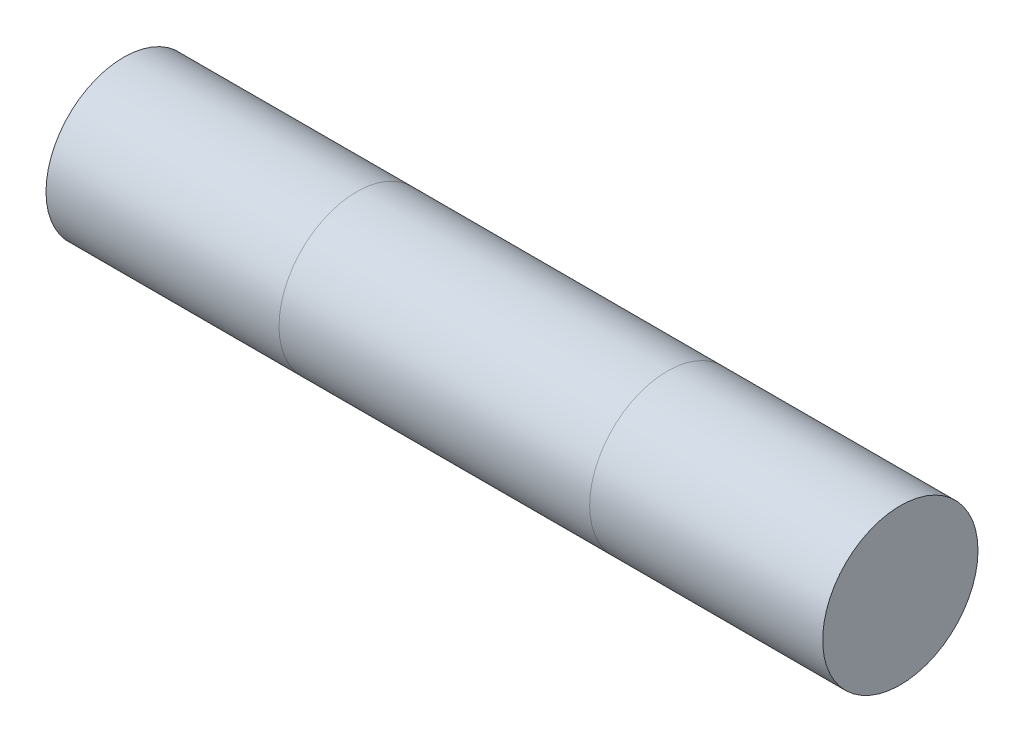
ISO-10303-21;
HEADER;
FILE_DESCRIPTION(('STEP AP214'),'2;1');
FILE_NAME('part.step','',(''),(''),'','','');
FILE_SCHEMA(('AUTOMOTIVE_DESIGN { 1 0 10303 214 1 1 1 1 }'));
ENDSEC;
DATA;
#1=APPLICATION_CONTEXT('core data for automotive mechanical design processes');
#2=APPLICATION_PROTOCOL_DEFINITION('international standard','automotive_design',2000,#1);
#3=PRODUCT_CONTEXT('',#1,'mechanical');
#4=PRODUCT('Part','Part','',(#3));
#5=PRODUCT_RELATED_PRODUCT_CATEGORY('part','',(#4));
#6=PRODUCT_DEFINITION_FORMATION('','',#4);
#7=PRODUCT_DEFINITION_CONTEXT('part definition',#1,'design');
#8=PRODUCT_DEFINITION('design','',#6,#7);
#9=PRODUCT_DEFINITION_SHAPE('','',#8);
#10=(LENGTH_UNIT() NAMED_UNIT(*) SI_UNIT(.MILLI.,.METRE.));
#11=(NAMED_UNIT(*) PLANE_ANGLE_UNIT() SI_UNIT($,.RADIAN.));
#12=(NAMED_UNIT(*) SI_UNIT($,.STERADIAN.) SOLID_ANGLE_UNIT());
#13=UNCERTAINTY_MEASURE_WITH_UNIT(LENGTH_MEASURE(1.E-05),#10,'distance_accuracy_value','');
#14=(GEOMETRIC_REPRESENTATION_CONTEXT(3) GLOBAL_UNCERTAINTY_ASSIGNED_CONTEXT((#13)) GLOBAL_UNIT_ASSIGNED_CONTEXT((#10,
#11,#12)) REPRESENTATION_CONTEXT('',''));
#15=CARTESIAN_POINT('',(0.,0.,0.));
#16=DIRECTION('',(0.,0.,1.));
#17=DIRECTION('',(1.,0.,0.));
#18=AXIS2_PLACEMENT_3D('',#15,#16,#17);
#19=CARTESIAN_POINT('',(25.,0.,0.));
#20=DIRECTION('',(-1.,0.,0.));
#21=DIRECTION('',(0.,0.,1.));
#22=AXIS2_PLACEMENT_3D('',#19,#20,#21);
#23=CYLINDRICAL_SURFACE('',#22,5.);
#24=CARTESIAN_POINT('',(-25.,0.,0.));
#25=DIRECTION('',(1.,0.,0.));
#26=DIRECTION('',(0.,0.,-1.));
#27=AXIS2_PLACEMENT_3D('',#24,#25,#26);
#28=CIRCLE('',#27,5.);
#29=CARTESIAN_POINT('',(-25.,0.,-5.));
#30=VERTEX_POINT('',#29);
#31=EDGE_CURVE('E54',#30,#30,#28,.T.);
#32=ORIENTED_EDGE('',*,*,#31,.T.);
#33=EDGE_LOOP('',(#32));
#34=FACE_BOUND('',#33,.T.);
#35=CARTESIAN_POINT('',(-10.,0.,0.));
#36=DIRECTION('',(-1.,0.,0.));
#37=DIRECTION('',(0.,0.,1.));
#38=AXIS2_PLACEMENT_3D('',#35,#36,#37);
#39=CIRCLE('',#38,5.);
#40=CARTESIAN_POINT('',(-10.,0.,5.));
#41=VERTEX_POINT('',#40);
#42=EDGE_CURVE('E11',#41,#41,#39,.T.);
#43=ORIENTED_EDGE('',*,*,#42,.T.);
#44=EDGE_LOOP('',(#43));
#45=FACE_BOUND('',#44,.T.);
#46=ADVANCED_FACE('F39',(#34,#45),#23,.T.);
#47=CARTESIAN_POINT('',(25.,0.,0.));
#48=DIRECTION('',(1.,0.,0.));
#49=DIRECTION('',(0.,0.,-1.));
#50=AXIS2_PLACEMENT_3D('',#47,#48,#49);
#51=CIRCLE('',#50,5.);
#52=CARTESIAN_POINT('',(25.,0.,-5.));
#53=VERTEX_POINT('',#52);
#54=EDGE_CURVE('E50',#53,#53,#51,.T.);
#55=ORIENTED_EDGE('',*,*,#54,.F.);
#56=EDGE_LOOP('',(#55));
#57=FACE_BOUND('',#56,.T.);
#58=CARTESIAN_POINT('',(10.,0.,0.));
#59=DIRECTION('',(1.,0.,0.));
#60=DIRECTION('',(0.,0.,-1.));
#61=AXIS2_PLACEMENT_3D('',#58,#59,#60);
#62=CIRCLE('',#61,5.);
#63=CARTESIAN_POINT('',(10.,0.,-5.));
#64=VERTEX_POINT('',#63);
#65=EDGE_CURVE('E46',#64,#64,#62,.T.);
#66=ORIENTED_EDGE('',*,*,#65,.T.);
#67=EDGE_LOOP('',(#66));
#68=FACE_BOUND('',#67,.T.);
#69=ADVANCED_FACE('F71',(#57,#68),#23,.T.);
#70=ORIENTED_EDGE('',*,*,#42,.F.);
#71=EDGE_LOOP('',(#70));
#72=FACE_BOUND('',#71,.T.);
#73=ORIENTED_EDGE('',*,*,#65,.F.);
#74=EDGE_LOOP('',(#73));
#75=FACE_BOUND('',#74,.T.);
#76=ADVANCED_FACE('F41',(#72,#75),#23,.T.);
#77=CARTESIAN_POINT('',(25.,0.,0.));
#78=DIRECTION('',(1.,0.,0.));
#79=DIRECTION('',(0.,0.,-1.));
#80=AXIS2_PLACEMENT_3D('',#77,#78,#79);
#81=PLANE('',#80);
#82=ORIENTED_EDGE('',*,*,#54,.T.);
#83=EDGE_LOOP('',(#82));
#84=FACE_BOUND('',#83,.T.);
#85=ADVANCED_FACE('F63',(#84),#81,.T.);
#86=CARTESIAN_POINT('',(-25.,0.,0.));
#87=DIRECTION('',(1.,0.,0.));
#88=DIRECTION('',(0.,0.,-1.));
#89=AXIS2_PLACEMENT_3D('',#86,#87,#88);
#90=PLANE('',#89);
#91=ORIENTED_EDGE('',*,*,#31,.F.);
#92=EDGE_LOOP('',(#91));
#93=FACE_BOUND('',#92,.T.);
#94=ADVANCED_FACE('F61',(#93),#90,.F.);
#95=CLOSED_SHELL('',(#46,#69,#76,#85,#94));
#96=MANIFOLD_SOLID_BREP('B2',#95);
#97=ADVANCED_BREP_SHAPE_REPRESENTATION('',(#18,#96),#14);
#98=SHAPE_DEFINITION_REPRESENTATION(#9,#97);
ENDSEC;
END-ISO-10303-21;
